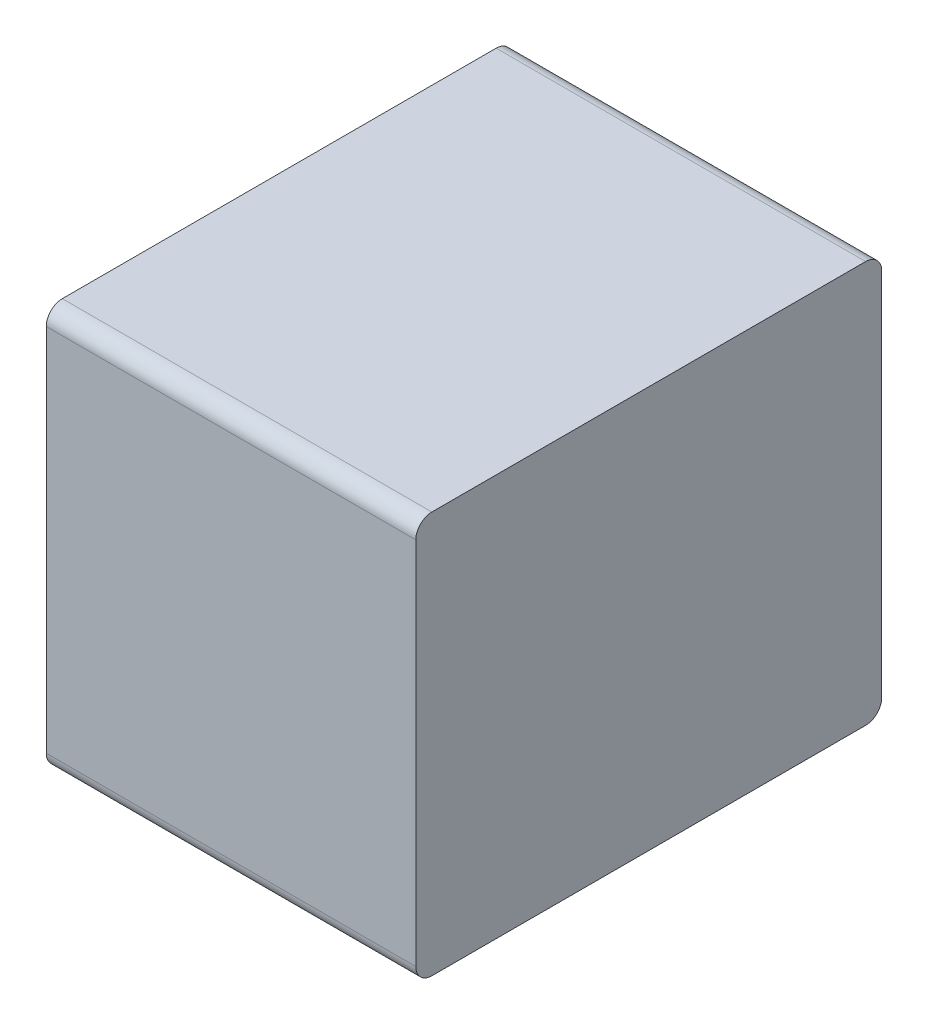
ISO-10303-21;
HEADER;
FILE_DESCRIPTION(('STEP AP214'),'2;1');
FILE_NAME('part.step','',(''),(''),'','','');
FILE_SCHEMA(('AUTOMOTIVE_DESIGN { 1 0 10303 214 1 1 1 1 }'));
ENDSEC;
DATA;
#1=APPLICATION_CONTEXT('core data for automotive mechanical design processes');
#2=APPLICATION_PROTOCOL_DEFINITION('international standard','automotive_design',2000,#1);
#3=PRODUCT_CONTEXT('',#1,'mechanical');
#4=PRODUCT('Part','Part','',(#3));
#5=PRODUCT_RELATED_PRODUCT_CATEGORY('part','',(#4));
#6=PRODUCT_DEFINITION_FORMATION('','',#4);
#7=PRODUCT_DEFINITION_CONTEXT('part definition',#1,'design');
#8=PRODUCT_DEFINITION('design','',#6,#7);
#9=PRODUCT_DEFINITION_SHAPE('','',#8);
#10=(LENGTH_UNIT() NAMED_UNIT(*) SI_UNIT(.MILLI.,.METRE.));
#11=(NAMED_UNIT(*) PLANE_ANGLE_UNIT() SI_UNIT($,.RADIAN.));
#12=(NAMED_UNIT(*) SI_UNIT($,.STERADIAN.) SOLID_ANGLE_UNIT());
#13=UNCERTAINTY_MEASURE_WITH_UNIT(LENGTH_MEASURE(1.E-05),#10,'distance_accuracy_value','');
#14=(GEOMETRIC_REPRESENTATION_CONTEXT(3) GLOBAL_UNCERTAINTY_ASSIGNED_CONTEXT((#13)) GLOBAL_UNIT_ASSIGNED_CONTEXT((#10,
#11,#12)) REPRESENTATION_CONTEXT('',''));
#15=CARTESIAN_POINT('',(0.,0.,0.));
#16=DIRECTION('',(0.,0.,1.));
#17=DIRECTION('',(1.,0.,0.));
#18=AXIS2_PLACEMENT_3D('',#15,#16,#17);
#19=CARTESIAN_POINT('',(0.2875,0.575,0.05));
#20=DIRECTION('',(1.,0.,0.));
#21=DIRECTION('',(0.,0.707106781186548,-0.707106781186547));
#22=AXIS2_PLACEMENT_3D('',#19,#20,#21);
#23=CYLINDRICAL_SURFACE('',#22,0.05);
#24=CARTESIAN_POINT('',(0.575,0.575,0.05));
#25=DIRECTION('',(-1.,0.,0.));
#26=DIRECTION('',(0.,1.,0.));
#27=AXIS2_PLACEMENT_3D('',#24,#25,#26);
#28=CIRCLE('',#27,0.05);
#29=CARTESIAN_POINT('',(0.575,0.625,0.05));
#30=VERTEX_POINT('',#29);
#31=CARTESIAN_POINT('',(0.575,0.575,0.));
#32=VERTEX_POINT('',#31);
#33=EDGE_CURVE('E11',#30,#32,#28,.T.);
#34=ORIENTED_EDGE('',*,*,#33,.T.);
#35=DIRECTION('',(-1.,0.,0.));
#36=VECTOR('',#35,1.);
#37=CARTESIAN_POINT('',(0.575,0.575,0.));
#38=LINE('',#37,#36);
#39=CARTESIAN_POINT('',(-0.575,0.575,0.));
#40=VERTEX_POINT('',#39);
#41=EDGE_CURVE('E144',#32,#40,#38,.T.);
#42=ORIENTED_EDGE('',*,*,#41,.T.);
#43=CARTESIAN_POINT('',(-0.575,0.575,0.05));
#44=DIRECTION('',(1.,0.,0.));
#45=DIRECTION('',(0.,0.,-1.));
#46=AXIS2_PLACEMENT_3D('',#43,#44,#45);
#47=CIRCLE('',#46,0.05);
#48=CARTESIAN_POINT('',(-0.575,0.625,0.05));
#49=VERTEX_POINT('',#48);
#50=EDGE_CURVE('E142',#40,#49,#47,.T.);
#51=ORIENTED_EDGE('',*,*,#50,.T.);
#52=DIRECTION('',(1.,0.,0.));
#53=VECTOR('',#52,1.);
#54=CARTESIAN_POINT('',(-0.575,0.625,0.05));
#55=LINE('',#54,#53);
#56=EDGE_CURVE('E24',#49,#30,#55,.T.);
#57=ORIENTED_EDGE('',*,*,#56,.T.);
#58=EDGE_LOOP('',(#34,#42,#51,#57));
#59=FACE_BOUND('',#58,.T.);
#60=ADVANCED_FACE('F17',(#59),#23,.T.);
#61=CARTESIAN_POINT('',(0.575,0.625,0.));
#62=DIRECTION('',(0.,1.,0.));
#63=DIRECTION('',(-1.,0.,0.));
#64=AXIS2_PLACEMENT_3D('',#61,#62,#63);
#65=PLANE('',#64);
#66=ORIENTED_EDGE('',*,*,#56,.F.);
#67=DIRECTION('',(0.,0.,1.));
#68=VECTOR('',#67,1.);
#69=CARTESIAN_POINT('',(-0.575,0.625,0.05));
#70=LINE('',#69,#68);
#71=CARTESIAN_POINT('',(-0.575,0.625,1.4));
#72=VERTEX_POINT('',#71);
#73=EDGE_CURVE('E140',#49,#72,#70,.T.);
#74=ORIENTED_EDGE('',*,*,#73,.T.);
#75=DIRECTION('',(-1.,0.,0.));
#76=VECTOR('',#75,1.);
#77=CARTESIAN_POINT('',(0.575,0.625,1.4));
#78=LINE('',#77,#76);
#79=CARTESIAN_POINT('',(0.575,0.625,1.4));
#80=VERTEX_POINT('',#79);
#81=EDGE_CURVE('E132',#80,#72,#78,.T.);
#82=ORIENTED_EDGE('',*,*,#81,.F.);
#83=DIRECTION('',(0.,0.,1.));
#84=VECTOR('',#83,1.);
#85=CARTESIAN_POINT('',(0.575,0.625,0.05));
#86=LINE('',#85,#84);
#87=EDGE_CURVE('E125',#30,#80,#86,.T.);
#88=ORIENTED_EDGE('',*,*,#87,.F.);
#89=EDGE_LOOP('',(#66,#74,#82,#88));
#90=FACE_BOUND('',#89,.T.);
#91=ADVANCED_FACE('F147',(#90),#65,.T.);
#92=CARTESIAN_POINT('',(-0.575,0.625,0.));
#93=DIRECTION('',(-1.,0.,0.));
#94=DIRECTION('',(0.,-1.,0.));
#95=AXIS2_PLACEMENT_3D('',#92,#93,#94);
#96=PLANE('',#95);
#97=ORIENTED_EDGE('',*,*,#50,.F.);
#98=DIRECTION('',(0.,1.,0.));
#99=VECTOR('',#98,1.);
#100=CARTESIAN_POINT('',(-0.575,-0.575,0.));
#101=LINE('',#100,#99);
#102=CARTESIAN_POINT('',(-0.575,-0.575,0.));
#103=VERTEX_POINT('',#102);
#104=EDGE_CURVE('E135',#103,#40,#101,.T.);
#105=ORIENTED_EDGE('',*,*,#104,.F.);
#106=CARTESIAN_POINT('',(-0.575,-0.575,0.05));
#107=DIRECTION('',(1.,0.,0.));
#108=DIRECTION('',(0.,-1.,0.));
#109=AXIS2_PLACEMENT_3D('',#106,#107,#108);
#110=CIRCLE('',#109,0.05);
#111=CARTESIAN_POINT('',(-0.575,-0.625,0.05));
#112=VERTEX_POINT('',#111);
#113=EDGE_CURVE('E138',#112,#103,#110,.T.);
#114=ORIENTED_EDGE('',*,*,#113,.F.);
#115=DIRECTION('',(0.,0.,1.));
#116=VECTOR('',#115,1.);
#117=CARTESIAN_POINT('',(-0.575,-0.625,0.05));
#118=LINE('',#117,#116);
#119=CARTESIAN_POINT('',(-0.575,-0.625,1.4));
#120=VERTEX_POINT('',#119);
#121=EDGE_CURVE('E118',#112,#120,#118,.T.);
#122=ORIENTED_EDGE('',*,*,#121,.T.);
#123=CARTESIAN_POINT('',(-0.575,-0.575,1.4));
#124=DIRECTION('',(1.,0.,0.));
#125=DIRECTION('',(0.,0.,1.));
#126=AXIS2_PLACEMENT_3D('',#123,#124,#125);
#127=CIRCLE('',#126,0.05);
#128=CARTESIAN_POINT('',(-0.575,-0.575,1.45));
#129=VERTEX_POINT('',#128);
#130=EDGE_CURVE('E113',#129,#120,#127,.T.);
#131=ORIENTED_EDGE('',*,*,#130,.F.);
#132=DIRECTION('',(0.,-1.,0.));
#133=VECTOR('',#132,1.);
#134=CARTESIAN_POINT('',(-0.575,0.575,1.45));
#135=LINE('',#134,#133);
#136=CARTESIAN_POINT('',(-0.575,0.575,1.45));
#137=VERTEX_POINT('',#136);
#138=EDGE_CURVE('E89',#137,#129,#135,.T.);
#139=ORIENTED_EDGE('',*,*,#138,.F.);
#140=CARTESIAN_POINT('',(-0.575,0.575,1.4));
#141=DIRECTION('',(1.,0.,0.));
#142=DIRECTION('',(0.,1.,0.));
#143=AXIS2_PLACEMENT_3D('',#140,#141,#142);
#144=CIRCLE('',#143,0.05);
#145=EDGE_CURVE('E116',#72,#137,#144,.T.);
#146=ORIENTED_EDGE('',*,*,#145,.F.);
#147=ORIENTED_EDGE('',*,*,#73,.F.);
#148=EDGE_LOOP('',(#97,#105,#114,#122,#131,#139,#146,#147));
#149=FACE_BOUND('',#148,.T.);
#150=ADVANCED_FACE('F155',(#149),#96,.T.);
#151=CARTESIAN_POINT('',(-0.2875,-0.575,0.05));
#152=DIRECTION('',(-1.,0.,0.));
#153=DIRECTION('',(0.,-0.707106781186548,-0.707106781186547));
#154=AXIS2_PLACEMENT_3D('',#151,#152,#153);
#155=CYLINDRICAL_SURFACE('',#154,0.05);
#156=ORIENTED_EDGE('',*,*,#113,.T.);
#157=DIRECTION('',(1.,0.,0.));
#158=VECTOR('',#157,1.);
#159=CARTESIAN_POINT('',(-0.575,-0.575,0.));
#160=LINE('',#159,#158);
#161=CARTESIAN_POINT('',(0.575,-0.575,0.));
#162=VERTEX_POINT('',#161);
#163=EDGE_CURVE('E127',#103,#162,#160,.T.);
#164=ORIENTED_EDGE('',*,*,#163,.T.);
#165=CARTESIAN_POINT('',(0.575,-0.575,0.05));
#166=DIRECTION('',(-1.,0.,0.));
#167=DIRECTION('',(0.,0.,-1.));
#168=AXIS2_PLACEMENT_3D('',#165,#166,#167);
#169=CIRCLE('',#168,0.05);
#170=CARTESIAN_POINT('',(0.575,-0.625,0.05));
#171=VERTEX_POINT('',#170);
#172=EDGE_CURVE('E120',#162,#171,#169,.T.);
#173=ORIENTED_EDGE('',*,*,#172,.T.);
#174=DIRECTION('',(-1.,0.,0.));
#175=VECTOR('',#174,1.);
#176=CARTESIAN_POINT('',(0.575,-0.625,0.05));
#177=LINE('',#176,#175);
#178=EDGE_CURVE('E129',#171,#112,#177,.T.);
#179=ORIENTED_EDGE('',*,*,#178,.T.);
#180=EDGE_LOOP('',(#156,#164,#173,#179));
#181=FACE_BOUND('',#180,.T.);
#182=ADVANCED_FACE('F177',(#181),#155,.T.);
#183=CARTESIAN_POINT('',(-0.575,-0.625,0.));
#184=DIRECTION('',(0.,-1.,0.));
#185=DIRECTION('',(1.,0.,0.));
#186=AXIS2_PLACEMENT_3D('',#183,#184,#185);
#187=PLANE('',#186);
#188=ORIENTED_EDGE('',*,*,#178,.F.);
#189=DIRECTION('',(0.,0.,1.));
#190=VECTOR('',#189,1.);
#191=CARTESIAN_POINT('',(0.575,-0.625,0.05));
#192=LINE('',#191,#190);
#193=CARTESIAN_POINT('',(0.575,-0.625,1.4));
#194=VERTEX_POINT('',#193);
#195=EDGE_CURVE('E123',#171,#194,#192,.T.);
#196=ORIENTED_EDGE('',*,*,#195,.T.);
#197=DIRECTION('',(1.,0.,0.));
#198=VECTOR('',#197,1.);
#199=CARTESIAN_POINT('',(-0.575,-0.625,1.4));
#200=LINE('',#199,#198);
#201=EDGE_CURVE('E86',#120,#194,#200,.T.);
#202=ORIENTED_EDGE('',*,*,#201,.F.);
#203=ORIENTED_EDGE('',*,*,#121,.F.);
#204=EDGE_LOOP('',(#188,#196,#202,#203));
#205=FACE_BOUND('',#204,.T.);
#206=ADVANCED_FACE('F167',(#205),#187,.T.);
#207=CARTESIAN_POINT('',(0.575,-0.625,0.));
#208=DIRECTION('',(1.,0.,0.));
#209=DIRECTION('',(0.,1.,0.));
#210=AXIS2_PLACEMENT_3D('',#207,#208,#209);
#211=PLANE('',#210);
#212=ORIENTED_EDGE('',*,*,#33,.F.);
#213=ORIENTED_EDGE('',*,*,#87,.T.);
#214=CARTESIAN_POINT('',(0.575,0.575,1.4));
#215=DIRECTION('',(-1.,0.,0.));
#216=DIRECTION('',(0.,0.,1.));
#217=AXIS2_PLACEMENT_3D('',#214,#215,#216);
#218=CIRCLE('',#217,0.05);
#219=CARTESIAN_POINT('',(0.575,0.575,1.45));
#220=VERTEX_POINT('',#219);
#221=EDGE_CURVE('E97',#220,#80,#218,.T.);
#222=ORIENTED_EDGE('',*,*,#221,.F.);
#223=DIRECTION('',(0.,1.,0.));
#224=VECTOR('',#223,1.);
#225=CARTESIAN_POINT('',(0.575,-0.575,1.45));
#226=LINE('',#225,#224);
#227=CARTESIAN_POINT('',(0.575,-0.575,1.45));
#228=VERTEX_POINT('',#227);
#229=EDGE_CURVE('E90',#228,#220,#226,.T.);
#230=ORIENTED_EDGE('',*,*,#229,.F.);
#231=CARTESIAN_POINT('',(0.575,-0.575,1.4));
#232=DIRECTION('',(-1.,0.,0.));
#233=DIRECTION('',(0.,-1.,0.));
#234=AXIS2_PLACEMENT_3D('',#231,#232,#233);
#235=CIRCLE('',#234,0.05);
#236=EDGE_CURVE('E79',#194,#228,#235,.T.);
#237=ORIENTED_EDGE('',*,*,#236,.F.);
#238=ORIENTED_EDGE('',*,*,#195,.F.);
#239=ORIENTED_EDGE('',*,*,#172,.F.);
#240=DIRECTION('',(0.,-1.,0.));
#241=VECTOR('',#240,1.);
#242=CARTESIAN_POINT('',(0.575,0.575,0.));
#243=LINE('',#242,#241);
#244=EDGE_CURVE('E104',#32,#162,#243,.T.);
#245=ORIENTED_EDGE('',*,*,#244,.F.);
#246=EDGE_LOOP('',(#212,#213,#222,#230,#237,#238,#239,#245));
#247=FACE_BOUND('',#246,.T.);
#248=ADVANCED_FACE('F94',(#247),#211,.T.);
#249=CARTESIAN_POINT('',(0.2875,0.575,1.4));
#250=DIRECTION('',(-1.,0.,0.));
#251=DIRECTION('',(0.,0.707106781186548,0.707106781186548));
#252=AXIS2_PLACEMENT_3D('',#249,#250,#251);
#253=CYLINDRICAL_SURFACE('',#252,0.05);
#254=ORIENTED_EDGE('',*,*,#145,.T.);
#255=DIRECTION('',(1.,0.,0.));
#256=VECTOR('',#255,1.);
#257=CARTESIAN_POINT('',(-0.575,0.575,1.45));
#258=LINE('',#257,#256);
#259=EDGE_CURVE('E111',#137,#220,#258,.T.);
#260=ORIENTED_EDGE('',*,*,#259,.T.);
#261=ORIENTED_EDGE('',*,*,#221,.T.);
#262=ORIENTED_EDGE('',*,*,#81,.T.);
#263=EDGE_LOOP('',(#254,#260,#261,#262));
#264=FACE_BOUND('',#263,.T.);
#265=ADVANCED_FACE('F158',(#264),#253,.T.);
#266=CARTESIAN_POINT('',(0.,0.,1.45));
#267=DIRECTION('',(0.,0.,1.));
#268=DIRECTION('',(1.,0.,0.));
#269=AXIS2_PLACEMENT_3D('',#266,#267,#268);
#270=PLANE('',#269);
#271=ORIENTED_EDGE('',*,*,#259,.F.);
#272=ORIENTED_EDGE('',*,*,#138,.T.);
#273=DIRECTION('',(-1.,0.,0.));
#274=VECTOR('',#273,1.);
#275=CARTESIAN_POINT('',(0.575,-0.575,1.45));
#276=LINE('',#275,#274);
#277=EDGE_CURVE('E84',#228,#129,#276,.T.);
#278=ORIENTED_EDGE('',*,*,#277,.F.);
#279=ORIENTED_EDGE('',*,*,#229,.T.);
#280=EDGE_LOOP('',(#271,#272,#278,#279));
#281=FACE_BOUND('',#280,.T.);
#282=ADVANCED_FACE('F102',(#281),#270,.T.);
#283=CARTESIAN_POINT('',(-0.2875,-0.575,1.4));
#284=DIRECTION('',(1.,0.,0.));
#285=DIRECTION('',(0.,-0.707106781186548,0.707106781186548));
#286=AXIS2_PLACEMENT_3D('',#283,#284,#285);
#287=CYLINDRICAL_SURFACE('',#286,0.05);
#288=ORIENTED_EDGE('',*,*,#236,.T.);
#289=ORIENTED_EDGE('',*,*,#277,.T.);
#290=ORIENTED_EDGE('',*,*,#130,.T.);
#291=ORIENTED_EDGE('',*,*,#201,.T.);
#292=EDGE_LOOP('',(#288,#289,#290,#291));
#293=FACE_BOUND('',#292,.T.);
#294=ADVANCED_FACE('F81',(#293),#287,.T.);
#295=CARTESIAN_POINT('',(0.,0.,0.));
#296=DIRECTION('',(0.,0.,1.));
#297=DIRECTION('',(1.,0.,0.));
#298=AXIS2_PLACEMENT_3D('',#295,#296,#297);
#299=PLANE('',#298);
#300=ORIENTED_EDGE('',*,*,#41,.F.);
#301=ORIENTED_EDGE('',*,*,#244,.T.);
#302=ORIENTED_EDGE('',*,*,#163,.F.);
#303=ORIENTED_EDGE('',*,*,#104,.T.);
#304=EDGE_LOOP('',(#300,#301,#302,#303));
#305=FACE_BOUND('',#304,.T.);
#306=ADVANCED_FACE('F152',(#305),#299,.F.);
#307=CLOSED_SHELL('',(#60,#91,#150,#182,#206,#248,#265,#282,#294,#306));
#308=MANIFOLD_SOLID_BREP('B1',#307);
#309=ADVANCED_BREP_SHAPE_REPRESENTATION('',(#18,#308),#14);
#310=SHAPE_DEFINITION_REPRESENTATION(#9,#309);
ENDSEC;
END-ISO-10303-21;
